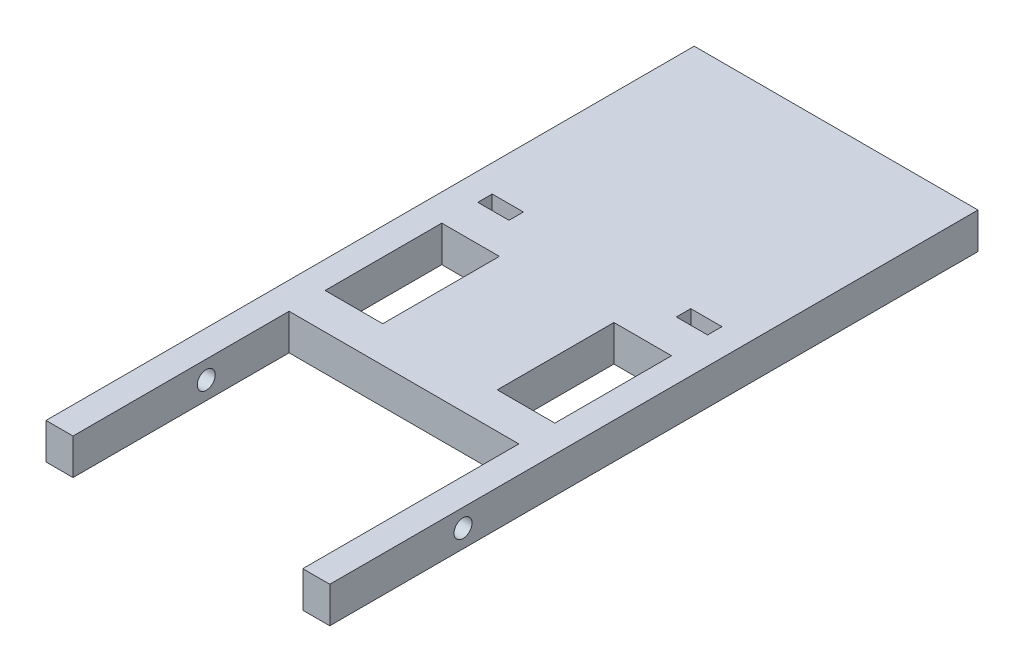
ISO-10303-21;
HEADER;
FILE_DESCRIPTION(('STEP AP214'),'2;1');
FILE_NAME('part.step','',(''),(''),'','','');
FILE_SCHEMA(('AUTOMOTIVE_DESIGN { 1 0 10303 214 1 1 1 1 }'));
ENDSEC;
DATA;
#1=APPLICATION_CONTEXT('core data for automotive mechanical design processes');
#2=APPLICATION_PROTOCOL_DEFINITION('international standard','automotive_design',2000,#1);
#3=PRODUCT_CONTEXT('',#1,'mechanical');
#4=PRODUCT('Part','Part','',(#3));
#5=PRODUCT_RELATED_PRODUCT_CATEGORY('part','',(#4));
#6=PRODUCT_DEFINITION_FORMATION('','',#4);
#7=PRODUCT_DEFINITION_CONTEXT('part definition',#1,'design');
#8=PRODUCT_DEFINITION('design','',#6,#7);
#9=PRODUCT_DEFINITION_SHAPE('','',#8);
#10=(LENGTH_UNIT() NAMED_UNIT(*) SI_UNIT(.MILLI.,.METRE.));
#11=(NAMED_UNIT(*) PLANE_ANGLE_UNIT() SI_UNIT($,.RADIAN.));
#12=(NAMED_UNIT(*) SI_UNIT($,.STERADIAN.) SOLID_ANGLE_UNIT());
#13=UNCERTAINTY_MEASURE_WITH_UNIT(LENGTH_MEASURE(1.E-05),#10,'distance_accuracy_value','');
#14=(GEOMETRIC_REPRESENTATION_CONTEXT(3) GLOBAL_UNCERTAINTY_ASSIGNED_CONTEXT((#13)) GLOBAL_UNIT_ASSIGNED_CONTEXT((#10,
#11,#12)) REPRESENTATION_CONTEXT('',''));
#15=CARTESIAN_POINT('',(0.,0.,0.));
#16=DIRECTION('',(0.,0.,1.));
#17=DIRECTION('',(1.,0.,0.));
#18=AXIS2_PLACEMENT_3D('',#15,#16,#17);
#19=CARTESIAN_POINT('',(-50.038,12.7,114.3));
#20=DIRECTION('',(0.,0.,-1.));
#21=DIRECTION('',(-1.,0.,0.));
#22=AXIS2_PLACEMENT_3D('',#19,#20,#21);
#23=PLANE('',#22);
#24=DIRECTION('',(1.,0.,0.));
#25=VECTOR('',#24,1.);
#26=CARTESIAN_POINT('',(-50.038,0.,114.3));
#27=LINE('',#26,#25);
#28=CARTESIAN_POINT('',(-50.038,0.,114.3));
#29=VERTEX_POINT('',#28);
#30=CARTESIAN_POINT('',(-40.513,0.,114.3));
#31=VERTEX_POINT('',#30);
#32=EDGE_CURVE('E362',#29,#31,#27,.T.);
#33=ORIENTED_EDGE('',*,*,#32,.T.);
#34=DIRECTION('',(0.,1.,0.));
#35=VECTOR('',#34,1.);
#36=CARTESIAN_POINT('',(-40.513,0.,114.3));
#37=LINE('',#36,#35);
#38=CARTESIAN_POINT('',(-40.513,12.7,114.3));
#39=VERTEX_POINT('',#38);
#40=EDGE_CURVE('E342',#31,#39,#37,.T.);
#41=ORIENTED_EDGE('',*,*,#40,.T.);
#42=DIRECTION('',(1.,0.,0.));
#43=VECTOR('',#42,1.);
#44=CARTESIAN_POINT('',(-50.038,12.7,114.3));
#45=LINE('',#44,#43);
#46=CARTESIAN_POINT('',(-50.038,12.7,114.3));
#47=VERTEX_POINT('',#46);
#48=EDGE_CURVE('E367',#47,#39,#45,.T.);
#49=ORIENTED_EDGE('',*,*,#48,.F.);
#50=DIRECTION('',(0.,-1.,0.));
#51=VECTOR('',#50,1.);
#52=CARTESIAN_POINT('',(-50.038,12.7,114.3));
#53=LINE('',#52,#51);
#54=EDGE_CURVE('E382',#47,#29,#53,.T.);
#55=ORIENTED_EDGE('',*,*,#54,.T.);
#56=EDGE_LOOP('',(#33,#41,#49,#55));
#57=FACE_BOUND('',#56,.T.);
#58=ADVANCED_FACE('F33',(#57),#23,.F.);
#59=CARTESIAN_POINT('',(50.038,12.7,-114.3));
#60=DIRECTION('',(-1.,0.,0.));
#61=DIRECTION('',(0.,0.,1.));
#62=AXIS2_PLACEMENT_3D('',#59,#60,#61);
#63=PLANE('',#62);
#64=CARTESIAN_POINT('',(50.038,6.35,67.31));
#65=DIRECTION('',(1.,0.,0.));
#66=DIRECTION('',(0.,0.,-1.));
#67=AXIS2_PLACEMENT_3D('',#64,#65,#66);
#68=CIRCLE('',#67,3.175);
#69=CARTESIAN_POINT('',(50.038,6.35,64.135));
#70=VERTEX_POINT('',#69);
#71=EDGE_CURVE('E456',#70,#70,#68,.T.);
#72=ORIENTED_EDGE('',*,*,#71,.F.);
#73=EDGE_LOOP('',(#72));
#74=FACE_BOUND('',#73,.T.);
#75=DIRECTION('',(0.,0.,-1.));
#76=VECTOR('',#75,1.);
#77=CARTESIAN_POINT('',(50.038,0.,-114.3));
#78=LINE('',#77,#76);
#79=CARTESIAN_POINT('',(50.038,0.,114.3));
#80=VERTEX_POINT('',#79);
#81=CARTESIAN_POINT('',(50.038,0.,-114.3));
#82=VERTEX_POINT('',#81);
#83=EDGE_CURVE('E351',#80,#82,#78,.T.);
#84=ORIENTED_EDGE('',*,*,#83,.T.);
#85=DIRECTION('',(0.,-1.,0.));
#86=VECTOR('',#85,1.);
#87=CARTESIAN_POINT('',(50.038,12.7,-114.3));
#88=LINE('',#87,#86);
#89=CARTESIAN_POINT('',(50.038,12.7,-114.3));
#90=VERTEX_POINT('',#89);
#91=EDGE_CURVE('E11',#90,#82,#88,.T.);
#92=ORIENTED_EDGE('',*,*,#91,.F.);
#93=DIRECTION('',(0.,0.,-1.));
#94=VECTOR('',#93,1.);
#95=CARTESIAN_POINT('',(50.038,12.7,-114.3));
#96=LINE('',#95,#94);
#97=CARTESIAN_POINT('',(50.038,12.7,114.3));
#98=VERTEX_POINT('',#97);
#99=EDGE_CURVE('E358',#98,#90,#96,.T.);
#100=ORIENTED_EDGE('',*,*,#99,.F.);
#101=DIRECTION('',(0.,-1.,0.));
#102=VECTOR('',#101,1.);
#103=CARTESIAN_POINT('',(50.038,12.7,114.3));
#104=LINE('',#103,#102);
#105=EDGE_CURVE('E370',#98,#80,#104,.T.);
#106=ORIENTED_EDGE('',*,*,#105,.T.);
#107=EDGE_LOOP('',(#84,#92,#100,#106));
#108=FACE_BOUND('',#107,.T.);
#109=ADVANCED_FACE('F35',(#74,#108),#63,.F.);
#110=CARTESIAN_POINT('',(-50.038,12.7,-114.3));
#111=DIRECTION('',(0.,0.,1.));
#112=DIRECTION('',(1.,0.,0.));
#113=AXIS2_PLACEMENT_3D('',#110,#111,#112);
#114=PLANE('',#113);
#115=DIRECTION('',(-1.,0.,0.));
#116=VECTOR('',#115,1.);
#117=CARTESIAN_POINT('',(-50.038,0.,-114.3));
#118=LINE('',#117,#116);
#119=CARTESIAN_POINT('',(-50.038,0.,-114.3));
#120=VERTEX_POINT('',#119);
#121=EDGE_CURVE('E373',#82,#120,#118,.T.);
#122=ORIENTED_EDGE('',*,*,#121,.T.);
#123=DIRECTION('',(0.,-1.,0.));
#124=VECTOR('',#123,1.);
#125=CARTESIAN_POINT('',(-50.038,12.7,-114.3));
#126=LINE('',#125,#124);
#127=CARTESIAN_POINT('',(-50.038,12.7,-114.3));
#128=VERTEX_POINT('',#127);
#129=EDGE_CURVE('E42',#128,#120,#126,.T.);
#130=ORIENTED_EDGE('',*,*,#129,.F.);
#131=DIRECTION('',(-1.,0.,0.));
#132=VECTOR('',#131,1.);
#133=CARTESIAN_POINT('',(-50.038,12.7,-114.3));
#134=LINE('',#133,#132);
#135=EDGE_CURVE('E361',#90,#128,#134,.T.);
#136=ORIENTED_EDGE('',*,*,#135,.F.);
#137=ORIENTED_EDGE('',*,*,#91,.T.);
#138=EDGE_LOOP('',(#122,#130,#136,#137));
#139=FACE_BOUND('',#138,.T.);
#140=ADVANCED_FACE('F405',(#139),#114,.F.);
#141=CARTESIAN_POINT('',(-50.038,12.7,-114.3));
#142=DIRECTION('',(1.,0.,0.));
#143=DIRECTION('',(0.,0.,-1.));
#144=AXIS2_PLACEMENT_3D('',#141,#142,#143);
#145=PLANE('',#144);
#146=CARTESIAN_POINT('',(-50.038,6.35,67.31));
#147=DIRECTION('',(1.,0.,0.));
#148=DIRECTION('',(0.,0.,-1.));
#149=AXIS2_PLACEMENT_3D('',#146,#147,#148);
#150=CIRCLE('',#149,3.175);
#151=CARTESIAN_POINT('',(-50.038,6.35,64.135));
#152=VERTEX_POINT('',#151);
#153=EDGE_CURVE('E454',#152,#152,#150,.T.);
#154=ORIENTED_EDGE('',*,*,#153,.T.);
#155=EDGE_LOOP('',(#154));
#156=FACE_BOUND('',#155,.T.);
#157=DIRECTION('',(0.,0.,1.));
#158=VECTOR('',#157,1.);
#159=CARTESIAN_POINT('',(-50.038,0.,-114.3));
#160=LINE('',#159,#158);
#161=EDGE_CURVE('E375',#120,#29,#160,.T.);
#162=ORIENTED_EDGE('',*,*,#161,.T.);
#163=ORIENTED_EDGE('',*,*,#54,.F.);
#164=DIRECTION('',(0.,0.,1.));
#165=VECTOR('',#164,1.);
#166=CARTESIAN_POINT('',(-50.038,12.7,-114.3));
#167=LINE('',#166,#165);
#168=EDGE_CURVE('E364',#128,#47,#167,.T.);
#169=ORIENTED_EDGE('',*,*,#168,.F.);
#170=ORIENTED_EDGE('',*,*,#129,.T.);
#171=EDGE_LOOP('',(#162,#163,#169,#170));
#172=FACE_BOUND('',#171,.T.);
#173=ADVANCED_FACE('F390',(#156,#172),#145,.F.);
#174=CARTESIAN_POINT('',(40.513,12.7,114.3));
#175=VERTEX_POINT('',#174);
#176=EDGE_CURVE('E366',#175,#98,#45,.T.);
#177=ORIENTED_EDGE('',*,*,#176,.F.);
#178=DIRECTION('',(0.,1.,0.));
#179=VECTOR('',#178,1.);
#180=CARTESIAN_POINT('',(40.513,0.,114.3));
#181=LINE('',#180,#179);
#182=CARTESIAN_POINT('',(40.513,0.,114.3));
#183=VERTEX_POINT('',#182);
#184=EDGE_CURVE('E354',#183,#175,#181,.T.);
#185=ORIENTED_EDGE('',*,*,#184,.F.);
#186=EDGE_CURVE('E377',#183,#80,#27,.T.);
#187=ORIENTED_EDGE('',*,*,#186,.T.);
#188=ORIENTED_EDGE('',*,*,#105,.F.);
#189=EDGE_LOOP('',(#177,#185,#187,#188));
#190=FACE_BOUND('',#189,.T.);
#191=ADVANCED_FACE('F412',(#190),#23,.F.);
#192=CARTESIAN_POINT('',(0.,12.7,0.));
#193=DIRECTION('',(0.,1.,0.));
#194=DIRECTION('',(0.,0.,1.));
#195=AXIS2_PLACEMENT_3D('',#192,#193,#194);
#196=PLANE('',#195);
#197=DIRECTION('',(0.,0.,1.));
#198=VECTOR('',#197,1.);
#199=CARTESIAN_POINT('',(-40.513,12.7,-33.528));
#200=LINE('',#199,#198);
#201=CARTESIAN_POINT('',(-40.513,12.7,-33.528));
#202=VERTEX_POINT('',#201);
#203=CARTESIAN_POINT('',(-40.513,12.7,-28.448));
#204=VERTEX_POINT('',#203);
#205=EDGE_CURVE('E49',#202,#204,#200,.T.);
#206=ORIENTED_EDGE('',*,*,#205,.F.);
#207=DIRECTION('',(-1.,0.,0.));
#208=VECTOR('',#207,1.);
#209=CARTESIAN_POINT('',(-40.513,12.7,-33.528));
#210=LINE('',#209,#208);
#211=CARTESIAN_POINT('',(-29.5148,12.7,-33.528));
#212=VERTEX_POINT('',#211);
#213=EDGE_CURVE('E216',#212,#202,#210,.T.);
#214=ORIENTED_EDGE('',*,*,#213,.F.);
#215=DIRECTION('',(0.,0.,-1.));
#216=VECTOR('',#215,1.);
#217=CARTESIAN_POINT('',(-29.5148,12.7,-33.528));
#218=LINE('',#217,#216);
#219=CARTESIAN_POINT('',(-29.5148,12.7,-28.448));
#220=VERTEX_POINT('',#219);
#221=EDGE_CURVE('E219',#220,#212,#218,.T.);
#222=ORIENTED_EDGE('',*,*,#221,.F.);
#223=DIRECTION('',(1.,0.,0.));
#224=VECTOR('',#223,1.);
#225=CARTESIAN_POINT('',(-40.513,12.7,-28.448));
#226=LINE('',#225,#224);
#227=EDGE_CURVE('E228',#204,#220,#226,.T.);
#228=ORIENTED_EDGE('',*,*,#227,.F.);
#229=EDGE_LOOP('',(#206,#214,#222,#228));
#230=FACE_BOUND('',#229,.T.);
#231=DIRECTION('',(-1.,0.,0.));
#232=VECTOR('',#231,1.);
#233=CARTESIAN_POINT('',(40.513,12.7,-15.748));
#234=LINE('',#233,#232);
#235=CARTESIAN_POINT('',(40.513,12.7,-15.748));
#236=VERTEX_POINT('',#235);
#237=CARTESIAN_POINT('',(20.193,12.7,-15.748));
#238=VERTEX_POINT('',#237);
#239=EDGE_CURVE('E57',#236,#238,#234,.T.);
#240=ORIENTED_EDGE('',*,*,#239,.F.);
#241=DIRECTION('',(0.,0.,-1.));
#242=VECTOR('',#241,1.);
#243=CARTESIAN_POINT('',(40.513,12.7,-15.748));
#244=LINE('',#243,#242);
#245=CARTESIAN_POINT('',(40.513,12.7,25.4));
#246=VERTEX_POINT('',#245);
#247=EDGE_CURVE('E243',#246,#236,#244,.T.);
#248=ORIENTED_EDGE('',*,*,#247,.F.);
#249=DIRECTION('',(1.,0.,0.));
#250=VECTOR('',#249,1.);
#251=CARTESIAN_POINT('',(40.513,12.7,25.4));
#252=LINE('',#251,#250);
#253=CARTESIAN_POINT('',(20.193,12.7,25.4));
#254=VERTEX_POINT('',#253);
#255=EDGE_CURVE('E258',#254,#246,#252,.T.);
#256=ORIENTED_EDGE('',*,*,#255,.F.);
#257=DIRECTION('',(0.,0.,1.));
#258=VECTOR('',#257,1.);
#259=CARTESIAN_POINT('',(20.193,12.7,-15.748));
#260=LINE('',#259,#258);
#261=EDGE_CURVE('E254',#238,#254,#260,.T.);
#262=ORIENTED_EDGE('',*,*,#261,.F.);
#263=EDGE_LOOP('',(#240,#248,#256,#262));
#264=FACE_BOUND('',#263,.T.);
#265=DIRECTION('',(-1.,0.,0.));
#266=VECTOR('',#265,1.);
#267=CARTESIAN_POINT('',(40.513,12.7,-33.528));
#268=LINE('',#267,#266);
#269=CARTESIAN_POINT('',(40.513,12.7,-33.528));
#270=VERTEX_POINT('',#269);
#271=CARTESIAN_POINT('',(29.5148,12.7,-33.528));
#272=VERTEX_POINT('',#271);
#273=EDGE_CURVE('E283',#270,#272,#268,.T.);
#274=ORIENTED_EDGE('',*,*,#273,.F.);
#275=DIRECTION('',(0.,0.,-1.));
#276=VECTOR('',#275,1.);
#277=CARTESIAN_POINT('',(40.513,12.7,-33.528));
#278=LINE('',#277,#276);
#279=CARTESIAN_POINT('',(40.513,12.7,-28.448));
#280=VERTEX_POINT('',#279);
#281=EDGE_CURVE('E273',#280,#270,#278,.T.);
#282=ORIENTED_EDGE('',*,*,#281,.F.);
#283=DIRECTION('',(1.,0.,0.));
#284=VECTOR('',#283,1.);
#285=CARTESIAN_POINT('',(40.513,12.7,-28.448));
#286=LINE('',#285,#284);
#287=CARTESIAN_POINT('',(29.5148,12.7,-28.448));
#288=VERTEX_POINT('',#287);
#289=EDGE_CURVE('E288',#288,#280,#286,.T.);
#290=ORIENTED_EDGE('',*,*,#289,.F.);
#291=DIRECTION('',(0.,0.,1.));
#292=VECTOR('',#291,1.);
#293=CARTESIAN_POINT('',(29.5148,12.7,-33.528));
#294=LINE('',#293,#292);
#295=EDGE_CURVE('E285',#272,#288,#294,.T.);
#296=ORIENTED_EDGE('',*,*,#295,.F.);
#297=EDGE_LOOP('',(#274,#282,#290,#296));
#298=FACE_BOUND('',#297,.T.);
#299=DIRECTION('',(0.,0.,1.));
#300=VECTOR('',#299,1.);
#301=CARTESIAN_POINT('',(-40.513,12.7,-15.748));
#302=LINE('',#301,#300);
#303=CARTESIAN_POINT('',(-40.513,12.7,-15.748));
#304=VERTEX_POINT('',#303);
#305=CARTESIAN_POINT('',(-40.513,12.7,25.4));
#306=VERTEX_POINT('',#305);
#307=EDGE_CURVE('E235',#304,#306,#302,.T.);
#308=ORIENTED_EDGE('',*,*,#307,.F.);
#309=DIRECTION('',(-1.,0.,0.));
#310=VECTOR('',#309,1.);
#311=CARTESIAN_POINT('',(-40.513,12.7,-15.748));
#312=LINE('',#311,#310);
#313=CARTESIAN_POINT('',(-20.193,12.7,-15.748));
#314=VERTEX_POINT('',#313);
#315=EDGE_CURVE('E304',#314,#304,#312,.T.);
#316=ORIENTED_EDGE('',*,*,#315,.F.);
#317=DIRECTION('',(0.,0.,-1.));
#318=VECTOR('',#317,1.);
#319=CARTESIAN_POINT('',(-20.193,12.7,-15.748));
#320=LINE('',#319,#318);
#321=CARTESIAN_POINT('',(-20.193,12.7,25.4));
#322=VERTEX_POINT('',#321);
#323=EDGE_CURVE('E318',#322,#314,#320,.T.);
#324=ORIENTED_EDGE('',*,*,#323,.F.);
#325=DIRECTION('',(1.,0.,0.));
#326=VECTOR('',#325,1.);
#327=CARTESIAN_POINT('',(-40.513,12.7,25.4));
#328=LINE('',#327,#326);
#329=EDGE_CURVE('E315',#306,#322,#328,.T.);
#330=ORIENTED_EDGE('',*,*,#329,.F.);
#331=EDGE_LOOP('',(#308,#316,#324,#330));
#332=FACE_BOUND('',#331,.T.);
#333=DIRECTION('',(0.,0.,1.));
#334=VECTOR('',#333,1.);
#335=CARTESIAN_POINT('',(-40.513,12.7,38.1));
#336=LINE('',#335,#334);
#337=CARTESIAN_POINT('',(-40.513,12.7,38.1));
#338=VERTEX_POINT('',#337);
#339=EDGE_CURVE('E325',#338,#39,#336,.T.);
#340=ORIENTED_EDGE('',*,*,#339,.F.);
#341=DIRECTION('',(-1.,0.,0.));
#342=VECTOR('',#341,1.);
#343=CARTESIAN_POINT('',(-40.513,12.7,38.1));
#344=LINE('',#343,#342);
#345=CARTESIAN_POINT('',(40.513,12.7,38.1));
#346=VERTEX_POINT('',#345);
#347=EDGE_CURVE('E336',#346,#338,#344,.T.);
#348=ORIENTED_EDGE('',*,*,#347,.F.);
#349=DIRECTION('',(0.,0.,-1.));
#350=VECTOR('',#349,1.);
#351=CARTESIAN_POINT('',(40.513,12.7,38.1));
#352=LINE('',#351,#350);
#353=EDGE_CURVE('E344',#175,#346,#352,.T.);
#354=ORIENTED_EDGE('',*,*,#353,.F.);
#355=ORIENTED_EDGE('',*,*,#176,.T.);
#356=ORIENTED_EDGE('',*,*,#99,.T.);
#357=ORIENTED_EDGE('',*,*,#135,.T.);
#358=ORIENTED_EDGE('',*,*,#168,.T.);
#359=ORIENTED_EDGE('',*,*,#48,.T.);
#360=EDGE_LOOP('',(#340,#348,#354,#355,#356,#357,#358,#359));
#361=FACE_BOUND('',#360,.T.);
#362=ADVANCED_FACE('F401',(#230,#264,#298,#332,#361),#196,.T.);
#363=CARTESIAN_POINT('',(0.,0.,0.));
#364=DIRECTION('',(0.,1.,0.));
#365=DIRECTION('',(0.,0.,1.));
#366=AXIS2_PLACEMENT_3D('',#363,#364,#365);
#367=PLANE('',#366);
#368=DIRECTION('',(-1.,0.,0.));
#369=VECTOR('',#368,1.);
#370=CARTESIAN_POINT('',(-40.513,0.,-33.528));
#371=LINE('',#370,#369);
#372=CARTESIAN_POINT('',(-29.5148,0.,-33.528));
#373=VERTEX_POINT('',#372);
#374=CARTESIAN_POINT('',(-40.513,0.,-33.528));
#375=VERTEX_POINT('',#374);
#376=EDGE_CURVE('E203',#373,#375,#371,.T.);
#377=ORIENTED_EDGE('',*,*,#376,.T.);
#378=DIRECTION('',(0.,0.,1.));
#379=VECTOR('',#378,1.);
#380=CARTESIAN_POINT('',(-40.513,0.,-33.528));
#381=LINE('',#380,#379);
#382=CARTESIAN_POINT('',(-40.513,0.,-28.448));
#383=VERTEX_POINT('',#382);
#384=EDGE_CURVE('E197',#375,#383,#381,.T.);
#385=ORIENTED_EDGE('',*,*,#384,.T.);
#386=DIRECTION('',(1.,0.,0.));
#387=VECTOR('',#386,1.);
#388=CARTESIAN_POINT('',(-40.513,0.,-28.448));
#389=LINE('',#388,#387);
#390=CARTESIAN_POINT('',(-29.5148,0.,-28.448));
#391=VERTEX_POINT('',#390);
#392=EDGE_CURVE('E207',#383,#391,#389,.T.);
#393=ORIENTED_EDGE('',*,*,#392,.T.);
#394=DIRECTION('',(0.,0.,-1.));
#395=VECTOR('',#394,1.);
#396=CARTESIAN_POINT('',(-29.5148,0.,-33.528));
#397=LINE('',#396,#395);
#398=EDGE_CURVE('E211',#391,#373,#397,.T.);
#399=ORIENTED_EDGE('',*,*,#398,.T.);
#400=EDGE_LOOP('',(#377,#385,#393,#399));
#401=FACE_BOUND('',#400,.T.);
#402=DIRECTION('',(0.,0.,-1.));
#403=VECTOR('',#402,1.);
#404=CARTESIAN_POINT('',(40.513,0.,-15.748));
#405=LINE('',#404,#403);
#406=CARTESIAN_POINT('',(40.513,0.,25.4));
#407=VERTEX_POINT('',#406);
#408=CARTESIAN_POINT('',(40.513,0.,-15.748));
#409=VERTEX_POINT('',#408);
#410=EDGE_CURVE('E249',#407,#409,#405,.T.);
#411=ORIENTED_EDGE('',*,*,#410,.T.);
#412=DIRECTION('',(-1.,0.,0.));
#413=VECTOR('',#412,1.);
#414=CARTESIAN_POINT('',(40.513,0.,-15.748));
#415=LINE('',#414,#413);
#416=CARTESIAN_POINT('',(20.193,0.,-15.748));
#417=VERTEX_POINT('',#416);
#418=EDGE_CURVE('E239',#409,#417,#415,.T.);
#419=ORIENTED_EDGE('',*,*,#418,.T.);
#420=DIRECTION('',(0.,0.,1.));
#421=VECTOR('',#420,1.);
#422=CARTESIAN_POINT('',(20.193,0.,-15.748));
#423=LINE('',#422,#421);
#424=CARTESIAN_POINT('',(20.193,0.,25.4));
#425=VERTEX_POINT('',#424);
#426=EDGE_CURVE('E242',#417,#425,#423,.T.);
#427=ORIENTED_EDGE('',*,*,#426,.T.);
#428=DIRECTION('',(1.,0.,0.));
#429=VECTOR('',#428,1.);
#430=CARTESIAN_POINT('',(40.513,0.,25.4));
#431=LINE('',#430,#429);
#432=EDGE_CURVE('E246',#425,#407,#431,.T.);
#433=ORIENTED_EDGE('',*,*,#432,.T.);
#434=EDGE_LOOP('',(#411,#419,#427,#433));
#435=FACE_BOUND('',#434,.T.);
#436=DIRECTION('',(0.,0.,-1.));
#437=VECTOR('',#436,1.);
#438=CARTESIAN_POINT('',(40.513,0.,-33.528));
#439=LINE('',#438,#437);
#440=CARTESIAN_POINT('',(40.513,0.,-28.448));
#441=VERTEX_POINT('',#440);
#442=CARTESIAN_POINT('',(40.513,0.,-33.528));
#443=VERTEX_POINT('',#442);
#444=EDGE_CURVE('E279',#441,#443,#439,.T.);
#445=ORIENTED_EDGE('',*,*,#444,.T.);
#446=DIRECTION('',(-1.,0.,0.));
#447=VECTOR('',#446,1.);
#448=CARTESIAN_POINT('',(40.513,0.,-33.528));
#449=LINE('',#448,#447);
#450=CARTESIAN_POINT('',(29.5148,0.,-33.528));
#451=VERTEX_POINT('',#450);
#452=EDGE_CURVE('E269',#443,#451,#449,.T.);
#453=ORIENTED_EDGE('',*,*,#452,.T.);
#454=DIRECTION('',(0.,0.,1.));
#455=VECTOR('',#454,1.);
#456=CARTESIAN_POINT('',(29.5148,0.,-33.528));
#457=LINE('',#456,#455);
#458=CARTESIAN_POINT('',(29.5148,0.,-28.448));
#459=VERTEX_POINT('',#458);
#460=EDGE_CURVE('E272',#451,#459,#457,.T.);
#461=ORIENTED_EDGE('',*,*,#460,.T.);
#462=DIRECTION('',(1.,0.,0.));
#463=VECTOR('',#462,1.);
#464=CARTESIAN_POINT('',(40.513,0.,-28.448));
#465=LINE('',#464,#463);
#466=EDGE_CURVE('E276',#459,#441,#465,.T.);
#467=ORIENTED_EDGE('',*,*,#466,.T.);
#468=EDGE_LOOP('',(#445,#453,#461,#467));
#469=FACE_BOUND('',#468,.T.);
#470=DIRECTION('',(-1.,0.,0.));
#471=VECTOR('',#470,1.);
#472=CARTESIAN_POINT('',(-40.513,0.,-15.748));
#473=LINE('',#472,#471);
#474=CARTESIAN_POINT('',(-20.193,0.,-15.748));
#475=VERTEX_POINT('',#474);
#476=CARTESIAN_POINT('',(-40.513,0.,-15.748));
#477=VERTEX_POINT('',#476);
#478=EDGE_CURVE('E310',#475,#477,#473,.T.);
#479=ORIENTED_EDGE('',*,*,#478,.T.);
#480=DIRECTION('',(0.,0.,1.));
#481=VECTOR('',#480,1.);
#482=CARTESIAN_POINT('',(-40.513,0.,-15.748));
#483=LINE('',#482,#481);
#484=CARTESIAN_POINT('',(-40.513,0.,25.4));
#485=VERTEX_POINT('',#484);
#486=EDGE_CURVE('E300',#477,#485,#483,.T.);
#487=ORIENTED_EDGE('',*,*,#486,.T.);
#488=DIRECTION('',(1.,0.,0.));
#489=VECTOR('',#488,1.);
#490=CARTESIAN_POINT('',(-40.513,0.,25.4));
#491=LINE('',#490,#489);
#492=CARTESIAN_POINT('',(-20.193,0.,25.4));
#493=VERTEX_POINT('',#492);
#494=EDGE_CURVE('E303',#485,#493,#491,.T.);
#495=ORIENTED_EDGE('',*,*,#494,.T.);
#496=DIRECTION('',(0.,0.,-1.));
#497=VECTOR('',#496,1.);
#498=CARTESIAN_POINT('',(-20.193,0.,-15.748));
#499=LINE('',#498,#497);
#500=EDGE_CURVE('E307',#493,#475,#499,.T.);
#501=ORIENTED_EDGE('',*,*,#500,.T.);
#502=EDGE_LOOP('',(#479,#487,#495,#501));
#503=FACE_BOUND('',#502,.T.);
#504=DIRECTION('',(-1.,0.,0.));
#505=VECTOR('',#504,1.);
#506=CARTESIAN_POINT('',(-40.513,0.,38.1));
#507=LINE('',#506,#505);
#508=CARTESIAN_POINT('',(40.513,0.,38.1));
#509=VERTEX_POINT('',#508);
#510=CARTESIAN_POINT('',(-40.513,0.,38.1));
#511=VERTEX_POINT('',#510);
#512=EDGE_CURVE('E339',#509,#511,#507,.T.);
#513=ORIENTED_EDGE('',*,*,#512,.T.);
#514=DIRECTION('',(0.,0.,1.));
#515=VECTOR('',#514,1.);
#516=CARTESIAN_POINT('',(-40.513,0.,38.1));
#517=LINE('',#516,#515);
#518=EDGE_CURVE('E332',#511,#31,#517,.T.);
#519=ORIENTED_EDGE('',*,*,#518,.T.);
#520=ORIENTED_EDGE('',*,*,#32,.F.);
#521=ORIENTED_EDGE('',*,*,#161,.F.);
#522=ORIENTED_EDGE('',*,*,#121,.F.);
#523=ORIENTED_EDGE('',*,*,#83,.F.);
#524=ORIENTED_EDGE('',*,*,#186,.F.);
#525=DIRECTION('',(0.,0.,-1.));
#526=VECTOR('',#525,1.);
#527=CARTESIAN_POINT('',(40.513,0.,38.1));
#528=LINE('',#527,#526);
#529=EDGE_CURVE('E335',#183,#509,#528,.T.);
#530=ORIENTED_EDGE('',*,*,#529,.T.);
#531=EDGE_LOOP('',(#513,#519,#520,#521,#522,#523,#524,#530));
#532=FACE_BOUND('',#531,.T.);
#533=ADVANCED_FACE('F213',(#401,#435,#469,#503,#532),#367,.F.);
#534=CARTESIAN_POINT('',(-40.513,0.,38.1));
#535=DIRECTION('',(-1.,0.,0.));
#536=DIRECTION('',(0.,0.,1.));
#537=AXIS2_PLACEMENT_3D('',#534,#535,#536);
#538=PLANE('',#537);
#539=CARTESIAN_POINT('',(-40.513,6.35,67.31));
#540=DIRECTION('',(-1.,0.,0.));
#541=DIRECTION('',(0.,0.,1.));
#542=AXIS2_PLACEMENT_3D('',#539,#540,#541);
#543=CIRCLE('',#542,3.175);
#544=CARTESIAN_POINT('',(-40.513,6.35,70.485));
#545=VERTEX_POINT('',#544);
#546=EDGE_CURVE('E222',#545,#545,#543,.T.);
#547=ORIENTED_EDGE('',*,*,#546,.T.);
#548=EDGE_LOOP('',(#547));
#549=FACE_BOUND('',#548,.T.);
#550=ORIENTED_EDGE('',*,*,#339,.T.);
#551=ORIENTED_EDGE('',*,*,#40,.F.);
#552=ORIENTED_EDGE('',*,*,#518,.F.);
#553=DIRECTION('',(0.,1.,0.));
#554=VECTOR('',#553,1.);
#555=CARTESIAN_POINT('',(-40.513,0.,38.1));
#556=LINE('',#555,#554);
#557=EDGE_CURVE('E349',#511,#338,#556,.T.);
#558=ORIENTED_EDGE('',*,*,#557,.T.);
#559=EDGE_LOOP('',(#550,#551,#552,#558));
#560=FACE_BOUND('',#559,.T.);
#561=ADVANCED_FACE('F420',(#549,#560),#538,.F.);
#562=CARTESIAN_POINT('',(-40.513,0.,38.1));
#563=DIRECTION('',(0.,0.,-1.));
#564=DIRECTION('',(-1.,0.,0.));
#565=AXIS2_PLACEMENT_3D('',#562,#563,#564);
#566=PLANE('',#565);
#567=ORIENTED_EDGE('',*,*,#347,.T.);
#568=ORIENTED_EDGE('',*,*,#557,.F.);
#569=ORIENTED_EDGE('',*,*,#512,.F.);
#570=DIRECTION('',(0.,1.,0.));
#571=VECTOR('',#570,1.);
#572=CARTESIAN_POINT('',(40.513,0.,38.1));
#573=LINE('',#572,#571);
#574=EDGE_CURVE('E352',#509,#346,#573,.T.);
#575=ORIENTED_EDGE('',*,*,#574,.T.);
#576=EDGE_LOOP('',(#567,#568,#569,#575));
#577=FACE_BOUND('',#576,.T.);
#578=ADVANCED_FACE('F418',(#577),#566,.F.);
#579=CARTESIAN_POINT('',(40.513,0.,38.1));
#580=DIRECTION('',(1.,0.,0.));
#581=DIRECTION('',(0.,0.,-1.));
#582=AXIS2_PLACEMENT_3D('',#579,#580,#581);
#583=PLANE('',#582);
#584=CARTESIAN_POINT('',(40.513,6.35,67.31));
#585=DIRECTION('',(1.,0.,0.));
#586=DIRECTION('',(0.,0.,-1.));
#587=AXIS2_PLACEMENT_3D('',#584,#585,#586);
#588=CIRCLE('',#587,3.175);
#589=CARTESIAN_POINT('',(40.513,6.35,64.135));
#590=VERTEX_POINT('',#589);
#591=EDGE_CURVE('E37',#590,#590,#588,.T.);
#592=ORIENTED_EDGE('',*,*,#591,.T.);
#593=EDGE_LOOP('',(#592));
#594=FACE_BOUND('',#593,.T.);
#595=ORIENTED_EDGE('',*,*,#353,.T.);
#596=ORIENTED_EDGE('',*,*,#574,.F.);
#597=ORIENTED_EDGE('',*,*,#529,.F.);
#598=ORIENTED_EDGE('',*,*,#184,.T.);
#599=EDGE_LOOP('',(#595,#596,#597,#598));
#600=FACE_BOUND('',#599,.T.);
#601=ADVANCED_FACE('F415',(#594,#600),#583,.F.);
#602=CARTESIAN_POINT('',(-40.513,0.,-15.748));
#603=DIRECTION('',(-1.,0.,0.));
#604=DIRECTION('',(0.,0.,1.));
#605=AXIS2_PLACEMENT_3D('',#602,#603,#604);
#606=PLANE('',#605);
#607=ORIENTED_EDGE('',*,*,#307,.T.);
#608=DIRECTION('',(0.,1.,0.));
#609=VECTOR('',#608,1.);
#610=CARTESIAN_POINT('',(-40.513,0.,25.4));
#611=LINE('',#610,#609);
#612=EDGE_CURVE('E313',#485,#306,#611,.T.);
#613=ORIENTED_EDGE('',*,*,#612,.F.);
#614=ORIENTED_EDGE('',*,*,#486,.F.);
#615=DIRECTION('',(0.,1.,0.));
#616=VECTOR('',#615,1.);
#617=CARTESIAN_POINT('',(-40.513,0.,-15.748));
#618=LINE('',#617,#616);
#619=EDGE_CURVE('E323',#477,#304,#618,.T.);
#620=ORIENTED_EDGE('',*,*,#619,.T.);
#621=EDGE_LOOP('',(#607,#613,#614,#620));
#622=FACE_BOUND('',#621,.T.);
#623=ADVANCED_FACE('F469',(#622),#606,.F.);
#624=CARTESIAN_POINT('',(-40.513,0.,-15.748));
#625=DIRECTION('',(0.,0.,-1.));
#626=DIRECTION('',(-1.,0.,0.));
#627=AXIS2_PLACEMENT_3D('',#624,#625,#626);
#628=PLANE('',#627);
#629=ORIENTED_EDGE('',*,*,#315,.T.);
#630=ORIENTED_EDGE('',*,*,#619,.F.);
#631=ORIENTED_EDGE('',*,*,#478,.F.);
#632=DIRECTION('',(0.,1.,0.));
#633=VECTOR('',#632,1.);
#634=CARTESIAN_POINT('',(-20.193,0.,-15.748));
#635=LINE('',#634,#633);
#636=EDGE_CURVE('E326',#475,#314,#635,.T.);
#637=ORIENTED_EDGE('',*,*,#636,.T.);
#638=EDGE_LOOP('',(#629,#630,#631,#637));
#639=FACE_BOUND('',#638,.T.);
#640=ADVANCED_FACE('F474',(#639),#628,.F.);
#641=CARTESIAN_POINT('',(-20.193,0.,-15.748));
#642=DIRECTION('',(1.,0.,0.));
#643=DIRECTION('',(0.,0.,-1.));
#644=AXIS2_PLACEMENT_3D('',#641,#642,#643);
#645=PLANE('',#644);
#646=ORIENTED_EDGE('',*,*,#323,.T.);
#647=ORIENTED_EDGE('',*,*,#636,.F.);
#648=ORIENTED_EDGE('',*,*,#500,.F.);
#649=DIRECTION('',(0.,1.,0.));
#650=VECTOR('',#649,1.);
#651=CARTESIAN_POINT('',(-20.193,0.,25.4));
#652=LINE('',#651,#650);
#653=EDGE_CURVE('E328',#493,#322,#652,.T.);
#654=ORIENTED_EDGE('',*,*,#653,.T.);
#655=EDGE_LOOP('',(#646,#647,#648,#654));
#656=FACE_BOUND('',#655,.T.);
#657=ADVANCED_FACE('F482',(#656),#645,.F.);
#658=CARTESIAN_POINT('',(-40.513,0.,25.4));
#659=DIRECTION('',(0.,0.,1.));
#660=DIRECTION('',(1.,0.,0.));
#661=AXIS2_PLACEMENT_3D('',#658,#659,#660);
#662=PLANE('',#661);
#663=ORIENTED_EDGE('',*,*,#329,.T.);
#664=ORIENTED_EDGE('',*,*,#653,.F.);
#665=ORIENTED_EDGE('',*,*,#494,.F.);
#666=ORIENTED_EDGE('',*,*,#612,.T.);
#667=EDGE_LOOP('',(#663,#664,#665,#666));
#668=FACE_BOUND('',#667,.T.);
#669=ADVANCED_FACE('F478',(#668),#662,.F.);
#670=CARTESIAN_POINT('',(40.513,0.,-33.528));
#671=DIRECTION('',(0.,0.,-1.));
#672=DIRECTION('',(-1.,0.,0.));
#673=AXIS2_PLACEMENT_3D('',#670,#671,#672);
#674=PLANE('',#673);
#675=ORIENTED_EDGE('',*,*,#273,.T.);
#676=DIRECTION('',(0.,1.,0.));
#677=VECTOR('',#676,1.);
#678=CARTESIAN_POINT('',(29.5148,0.,-33.528));
#679=LINE('',#678,#677);
#680=EDGE_CURVE('E282',#451,#272,#679,.T.);
#681=ORIENTED_EDGE('',*,*,#680,.F.);
#682=ORIENTED_EDGE('',*,*,#452,.F.);
#683=DIRECTION('',(0.,1.,0.));
#684=VECTOR('',#683,1.);
#685=CARTESIAN_POINT('',(40.513,0.,-33.528));
#686=LINE('',#685,#684);
#687=EDGE_CURVE('E255',#443,#270,#686,.T.);
#688=ORIENTED_EDGE('',*,*,#687,.T.);
#689=EDGE_LOOP('',(#675,#681,#682,#688));
#690=FACE_BOUND('',#689,.T.);
#691=ADVANCED_FACE('F481',(#690),#674,.F.);
#692=CARTESIAN_POINT('',(40.513,0.,-33.528));
#693=DIRECTION('',(1.,0.,0.));
#694=DIRECTION('',(0.,0.,-1.));
#695=AXIS2_PLACEMENT_3D('',#692,#693,#694);
#696=PLANE('',#695);
#697=ORIENTED_EDGE('',*,*,#281,.T.);
#698=ORIENTED_EDGE('',*,*,#687,.F.);
#699=ORIENTED_EDGE('',*,*,#444,.F.);
#700=DIRECTION('',(0.,1.,0.));
#701=VECTOR('',#700,1.);
#702=CARTESIAN_POINT('',(40.513,0.,-28.448));
#703=LINE('',#702,#701);
#704=EDGE_CURVE('E294',#441,#280,#703,.T.);
#705=ORIENTED_EDGE('',*,*,#704,.T.);
#706=EDGE_LOOP('',(#697,#698,#699,#705));
#707=FACE_BOUND('',#706,.T.);
#708=ADVANCED_FACE('F492',(#707),#696,.F.);
#709=CARTESIAN_POINT('',(40.513,0.,-28.448));
#710=DIRECTION('',(0.,0.,1.));
#711=DIRECTION('',(1.,0.,0.));
#712=AXIS2_PLACEMENT_3D('',#709,#710,#711);
#713=PLANE('',#712);
#714=ORIENTED_EDGE('',*,*,#289,.T.);
#715=ORIENTED_EDGE('',*,*,#704,.F.);
#716=ORIENTED_EDGE('',*,*,#466,.F.);
#717=DIRECTION('',(0.,1.,0.));
#718=VECTOR('',#717,1.);
#719=CARTESIAN_POINT('',(29.5148,0.,-28.448));
#720=LINE('',#719,#718);
#721=EDGE_CURVE('E296',#459,#288,#720,.T.);
#722=ORIENTED_EDGE('',*,*,#721,.T.);
#723=EDGE_LOOP('',(#714,#715,#716,#722));
#724=FACE_BOUND('',#723,.T.);
#725=ADVANCED_FACE('F498',(#724),#713,.F.);
#726=CARTESIAN_POINT('',(29.5148,0.,-33.528));
#727=DIRECTION('',(-1.,0.,0.));
#728=DIRECTION('',(0.,0.,1.));
#729=AXIS2_PLACEMENT_3D('',#726,#727,#728);
#730=PLANE('',#729);
#731=ORIENTED_EDGE('',*,*,#295,.T.);
#732=ORIENTED_EDGE('',*,*,#721,.F.);
#733=ORIENTED_EDGE('',*,*,#460,.F.);
#734=ORIENTED_EDGE('',*,*,#680,.T.);
#735=EDGE_LOOP('',(#731,#732,#733,#734));
#736=FACE_BOUND('',#735,.T.);
#737=ADVANCED_FACE('F494',(#736),#730,.F.);
#738=CARTESIAN_POINT('',(40.513,0.,-15.748));
#739=DIRECTION('',(0.,0.,-1.));
#740=DIRECTION('',(-1.,0.,0.));
#741=AXIS2_PLACEMENT_3D('',#738,#739,#740);
#742=PLANE('',#741);
#743=ORIENTED_EDGE('',*,*,#239,.T.);
#744=DIRECTION('',(0.,1.,0.));
#745=VECTOR('',#744,1.);
#746=CARTESIAN_POINT('',(20.193,0.,-15.748));
#747=LINE('',#746,#745);
#748=EDGE_CURVE('E252',#417,#238,#747,.T.);
#749=ORIENTED_EDGE('',*,*,#748,.F.);
#750=ORIENTED_EDGE('',*,*,#418,.F.);
#751=DIRECTION('',(0.,1.,0.));
#752=VECTOR('',#751,1.);
#753=CARTESIAN_POINT('',(40.513,0.,-15.748));
#754=LINE('',#753,#752);
#755=EDGE_CURVE('E229',#409,#236,#754,.T.);
#756=ORIENTED_EDGE('',*,*,#755,.T.);
#757=EDGE_LOOP('',(#743,#749,#750,#756));
#758=FACE_BOUND('',#757,.T.);
#759=ADVANCED_FACE('F497',(#758),#742,.F.);
#760=CARTESIAN_POINT('',(40.513,0.,-15.748));
#761=DIRECTION('',(1.,0.,0.));
#762=DIRECTION('',(0.,0.,-1.));
#763=AXIS2_PLACEMENT_3D('',#760,#761,#762);
#764=PLANE('',#763);
#765=ORIENTED_EDGE('',*,*,#247,.T.);
#766=ORIENTED_EDGE('',*,*,#755,.F.);
#767=ORIENTED_EDGE('',*,*,#410,.F.);
#768=DIRECTION('',(0.,1.,0.));
#769=VECTOR('',#768,1.);
#770=CARTESIAN_POINT('',(40.513,0.,25.4));
#771=LINE('',#770,#769);
#772=EDGE_CURVE('E264',#407,#246,#771,.T.);
#773=ORIENTED_EDGE('',*,*,#772,.T.);
#774=EDGE_LOOP('',(#765,#766,#767,#773));
#775=FACE_BOUND('',#774,.T.);
#776=ADVANCED_FACE('F508',(#775),#764,.F.);
#777=CARTESIAN_POINT('',(40.513,0.,25.4));
#778=DIRECTION('',(0.,0.,1.));
#779=DIRECTION('',(1.,0.,0.));
#780=AXIS2_PLACEMENT_3D('',#777,#778,#779);
#781=PLANE('',#780);
#782=ORIENTED_EDGE('',*,*,#255,.T.);
#783=ORIENTED_EDGE('',*,*,#772,.F.);
#784=ORIENTED_EDGE('',*,*,#432,.F.);
#785=DIRECTION('',(0.,1.,0.));
#786=VECTOR('',#785,1.);
#787=CARTESIAN_POINT('',(20.193,0.,25.4));
#788=LINE('',#787,#786);
#789=EDGE_CURVE('E266',#425,#254,#788,.T.);
#790=ORIENTED_EDGE('',*,*,#789,.T.);
#791=EDGE_LOOP('',(#782,#783,#784,#790));
#792=FACE_BOUND('',#791,.T.);
#793=ADVANCED_FACE('F512',(#792),#781,.F.);
#794=CARTESIAN_POINT('',(20.193,0.,-15.748));
#795=DIRECTION('',(-1.,0.,0.));
#796=DIRECTION('',(0.,0.,1.));
#797=AXIS2_PLACEMENT_3D('',#794,#795,#796);
#798=PLANE('',#797);
#799=ORIENTED_EDGE('',*,*,#261,.T.);
#800=ORIENTED_EDGE('',*,*,#789,.F.);
#801=ORIENTED_EDGE('',*,*,#426,.F.);
#802=ORIENTED_EDGE('',*,*,#748,.T.);
#803=EDGE_LOOP('',(#799,#800,#801,#802));
#804=FACE_BOUND('',#803,.T.);
#805=ADVANCED_FACE('F509',(#804),#798,.F.);
#806=CARTESIAN_POINT('',(-40.513,0.,-33.528));
#807=DIRECTION('',(-1.,0.,0.));
#808=DIRECTION('',(0.,0.,1.));
#809=AXIS2_PLACEMENT_3D('',#806,#807,#808);
#810=PLANE('',#809);
#811=ORIENTED_EDGE('',*,*,#205,.T.);
#812=DIRECTION('',(0.,1.,0.));
#813=VECTOR('',#812,1.);
#814=CARTESIAN_POINT('',(-40.513,0.,-28.448));
#815=LINE('',#814,#813);
#816=EDGE_CURVE('E193',#383,#204,#815,.T.);
#817=ORIENTED_EDGE('',*,*,#816,.F.);
#818=ORIENTED_EDGE('',*,*,#384,.F.);
#819=DIRECTION('',(0.,1.,0.));
#820=VECTOR('',#819,1.);
#821=CARTESIAN_POINT('',(-40.513,0.,-33.528));
#822=LINE('',#821,#820);
#823=EDGE_CURVE('E233',#375,#202,#822,.T.);
#824=ORIENTED_EDGE('',*,*,#823,.T.);
#825=EDGE_LOOP('',(#811,#817,#818,#824));
#826=FACE_BOUND('',#825,.T.);
#827=ADVANCED_FACE('F195',(#826),#810,.F.);
#828=CARTESIAN_POINT('',(-40.513,0.,-33.528));
#829=DIRECTION('',(0.,0.,-1.));
#830=DIRECTION('',(-1.,0.,0.));
#831=AXIS2_PLACEMENT_3D('',#828,#829,#830);
#832=PLANE('',#831);
#833=ORIENTED_EDGE('',*,*,#213,.T.);
#834=ORIENTED_EDGE('',*,*,#823,.F.);
#835=ORIENTED_EDGE('',*,*,#376,.F.);
#836=DIRECTION('',(0.,1.,0.));
#837=VECTOR('',#836,1.);
#838=CARTESIAN_POINT('',(-29.5148,0.,-33.528));
#839=LINE('',#838,#837);
#840=EDGE_CURVE('E236',#373,#212,#839,.T.);
#841=ORIENTED_EDGE('',*,*,#840,.T.);
#842=EDGE_LOOP('',(#833,#834,#835,#841));
#843=FACE_BOUND('',#842,.T.);
#844=ADVANCED_FACE('F522',(#843),#832,.F.);
#845=CARTESIAN_POINT('',(-29.5148,0.,-33.528));
#846=DIRECTION('',(1.,0.,0.));
#847=DIRECTION('',(0.,0.,-1.));
#848=AXIS2_PLACEMENT_3D('',#845,#846,#847);
#849=PLANE('',#848);
#850=ORIENTED_EDGE('',*,*,#221,.T.);
#851=ORIENTED_EDGE('',*,*,#840,.F.);
#852=ORIENTED_EDGE('',*,*,#398,.F.);
#853=DIRECTION('',(0.,1.,0.));
#854=VECTOR('',#853,1.);
#855=CARTESIAN_POINT('',(-29.5148,0.,-28.448));
#856=LINE('',#855,#854);
#857=EDGE_CURVE('E202',#391,#220,#856,.T.);
#858=ORIENTED_EDGE('',*,*,#857,.T.);
#859=EDGE_LOOP('',(#850,#851,#852,#858));
#860=FACE_BOUND('',#859,.T.);
#861=ADVANCED_FACE('F525',(#860),#849,.F.);
#862=CARTESIAN_POINT('',(-40.513,0.,-28.448));
#863=DIRECTION('',(0.,0.,1.));
#864=DIRECTION('',(1.,0.,0.));
#865=AXIS2_PLACEMENT_3D('',#862,#863,#864);
#866=PLANE('',#865);
#867=ORIENTED_EDGE('',*,*,#227,.T.);
#868=ORIENTED_EDGE('',*,*,#857,.F.);
#869=ORIENTED_EDGE('',*,*,#392,.F.);
#870=ORIENTED_EDGE('',*,*,#816,.T.);
#871=EDGE_LOOP('',(#867,#868,#869,#870));
#872=FACE_BOUND('',#871,.T.);
#873=ADVANCED_FACE('F208',(#872),#866,.F.);
#874=CARTESIAN_POINT('',(-50.038,6.35,67.31));
#875=DIRECTION('',(1.,0.,0.));
#876=DIRECTION('',(0.,0.,-1.));
#877=AXIS2_PLACEMENT_3D('',#874,#875,#876);
#878=CYLINDRICAL_SURFACE('',#877,3.175);
#879=ORIENTED_EDGE('',*,*,#71,.T.);
#880=EDGE_LOOP('',(#879));
#881=FACE_BOUND('',#880,.T.);
#882=ORIENTED_EDGE('',*,*,#591,.F.);
#883=EDGE_LOOP('',(#882));
#884=FACE_BOUND('',#883,.T.);
#885=ADVANCED_FACE('F462',(#881,#884),#878,.F.);
#886=ORIENTED_EDGE('',*,*,#153,.F.);
#887=EDGE_LOOP('',(#886));
#888=FACE_BOUND('',#887,.T.);
#889=ORIENTED_EDGE('',*,*,#546,.F.);
#890=EDGE_LOOP('',(#889));
#891=FACE_BOUND('',#890,.T.);
#892=ADVANCED_FACE('F465',(#888,#891),#878,.F.);
#893=CLOSED_SHELL('',(#58,#109,#140,#173,#191,#362,#533,#561,#578,#601,#623,#640,#657,#669,#691,
#708,#725,#737,#759,#776,#793,#805,#827,#844,#861,#873,#885,#892));
#894=MANIFOLD_SOLID_BREP('B2',#893);
#895=ADVANCED_BREP_SHAPE_REPRESENTATION('',(#18,#894),#14);
#896=SHAPE_DEFINITION_REPRESENTATION(#9,#895);
ENDSEC;
END-ISO-10303-21;
